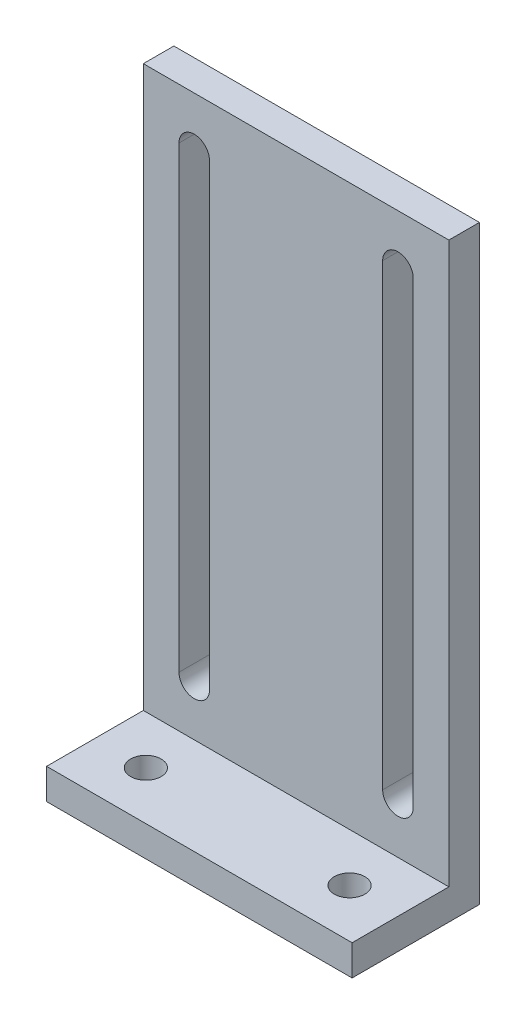
ISO-10303-21;
HEADER;
FILE_DESCRIPTION(('STEP AP214'),'2;1');
FILE_NAME('part.step','',(''),(''),'','','');
FILE_SCHEMA(('AUTOMOTIVE_DESIGN { 1 0 10303 214 1 1 1 1 }'));
ENDSEC;
DATA;
#1=APPLICATION_CONTEXT('core data for automotive mechanical design processes');
#2=APPLICATION_PROTOCOL_DEFINITION('international standard','automotive_design',2000,#1);
#3=PRODUCT_CONTEXT('',#1,'mechanical');
#4=PRODUCT('Part','Part','',(#3));
#5=PRODUCT_RELATED_PRODUCT_CATEGORY('part','',(#4));
#6=PRODUCT_DEFINITION_FORMATION('','',#4);
#7=PRODUCT_DEFINITION_CONTEXT('part definition',#1,'design');
#8=PRODUCT_DEFINITION('design','',#6,#7);
#9=PRODUCT_DEFINITION_SHAPE('','',#8);
#10=(LENGTH_UNIT() NAMED_UNIT(*) SI_UNIT(.MILLI.,.METRE.));
#11=(NAMED_UNIT(*) PLANE_ANGLE_UNIT() SI_UNIT($,.RADIAN.));
#12=(NAMED_UNIT(*) SI_UNIT($,.STERADIAN.) SOLID_ANGLE_UNIT());
#13=UNCERTAINTY_MEASURE_WITH_UNIT(LENGTH_MEASURE(1.E-05),#10,'distance_accuracy_value','');
#14=(GEOMETRIC_REPRESENTATION_CONTEXT(3) GLOBAL_UNCERTAINTY_ASSIGNED_CONTEXT((#13)) GLOBAL_UNIT_ASSIGNED_CONTEXT((#10,
#11,#12)) REPRESENTATION_CONTEXT('',''));
#15=CARTESIAN_POINT('',(0.,0.,0.));
#16=DIRECTION('',(0.,0.,1.));
#17=DIRECTION('',(1.,0.,0.));
#18=AXIS2_PLACEMENT_3D('',#15,#16,#17);
#19=CARTESIAN_POINT('',(0.,3.,0.));
#20=DIRECTION('',(0.,-1.,0.));
#21=DIRECTION('',(0.,0.,-1.));
#22=AXIS2_PLACEMENT_3D('',#19,#20,#21);
#23=PLANE('',#22);
#24=CARTESIAN_POINT('',(-10.,3.,1.5));
#25=DIRECTION('',(0.,1.,0.));
#26=DIRECTION('',(0.,0.,1.));
#27=AXIS2_PLACEMENT_3D('',#24,#25,#26);
#28=CIRCLE('',#27,1.5);
#29=CARTESIAN_POINT('',(-10.,3.,3.));
#30=VERTEX_POINT('',#29);
#31=EDGE_CURVE('E537',#30,#30,#28,.T.);
#32=ORIENTED_EDGE('',*,*,#31,.F.);
#33=EDGE_LOOP('',(#32));
#34=FACE_BOUND('',#33,.T.);
#35=CARTESIAN_POINT('',(9.99999999999999,3.,1.5));
#36=DIRECTION('',(0.,1.,0.));
#37=DIRECTION('',(0.,0.,-1.));
#38=AXIS2_PLACEMENT_3D('',#35,#36,#37);
#39=CIRCLE('',#38,1.5);
#40=CARTESIAN_POINT('',(9.99999999999999,3.,0.));
#41=VERTEX_POINT('',#40);
#42=EDGE_CURVE('E539',#41,#41,#39,.T.);
#43=ORIENTED_EDGE('',*,*,#42,.F.);
#44=EDGE_LOOP('',(#43));
#45=FACE_BOUND('',#44,.T.);
#46=DIRECTION('',(1.,0.,0.));
#47=VECTOR('',#46,1.);
#48=CARTESIAN_POINT('',(-15.,3.,-3.25));
#49=LINE('',#48,#47);
#50=CARTESIAN_POINT('',(-15.,3.,-3.25));
#51=VERTEX_POINT('',#50);
#52=CARTESIAN_POINT('',(15.,3.,-3.25));
#53=VERTEX_POINT('',#52);
#54=EDGE_CURVE('E197',#51,#53,#49,.T.);
#55=ORIENTED_EDGE('',*,*,#54,.F.);
#56=DIRECTION('',(0.,0.,1.));
#57=VECTOR('',#56,1.);
#58=CARTESIAN_POINT('',(-15.,3.,-6.25));
#59=LINE('',#58,#57);
#60=CARTESIAN_POINT('',(-15.,3.,6.25));
#61=VERTEX_POINT('',#60);
#62=EDGE_CURVE('E280',#51,#61,#59,.T.);
#63=ORIENTED_EDGE('',*,*,#62,.T.);
#64=DIRECTION('',(-1.,0.,0.));
#65=VECTOR('',#64,1.);
#66=CARTESIAN_POINT('',(15.,3.,6.25));
#67=LINE('',#66,#65);
#68=CARTESIAN_POINT('',(15.,3.,6.25));
#69=VERTEX_POINT('',#68);
#70=EDGE_CURVE('E275',#69,#61,#67,.T.);
#71=ORIENTED_EDGE('',*,*,#70,.F.);
#72=DIRECTION('',(0.,0.,1.));
#73=VECTOR('',#72,1.);
#74=CARTESIAN_POINT('',(15.,3.,-6.25));
#75=LINE('',#74,#73);
#76=EDGE_CURVE('E272',#53,#69,#75,.T.);
#77=ORIENTED_EDGE('',*,*,#76,.F.);
#78=EDGE_LOOP('',(#55,#63,#71,#77));
#79=FACE_BOUND('',#78,.T.);
#80=ADVANCED_FACE('F43',(#34,#45,#79),#23,.F.);
#81=CARTESIAN_POINT('',(15.,3.,-6.25));
#82=DIRECTION('',(1.,0.,0.));
#83=DIRECTION('',(0.,0.,-1.));
#84=AXIS2_PLACEMENT_3D('',#81,#82,#83);
#85=PLANE('',#84);
#86=DIRECTION('',(0.,0.,1.));
#87=VECTOR('',#86,1.);
#88=CARTESIAN_POINT('',(15.,0.,-6.25));
#89=LINE('',#88,#87);
#90=CARTESIAN_POINT('',(15.,0.,-6.25));
#91=VERTEX_POINT('',#90);
#92=CARTESIAN_POINT('',(15.,0.,6.25));
#93=VERTEX_POINT('',#92);
#94=EDGE_CURVE('E271',#91,#93,#89,.T.);
#95=ORIENTED_EDGE('',*,*,#94,.F.);
#96=DIRECTION('',(0.,-1.,0.));
#97=VECTOR('',#96,1.);
#98=CARTESIAN_POINT('',(15.,3.,-6.25));
#99=LINE('',#98,#97);
#100=CARTESIAN_POINT('',(15.,58.,-6.25));
#101=VERTEX_POINT('',#100);
#102=EDGE_CURVE('E11',#101,#91,#99,.T.);
#103=ORIENTED_EDGE('',*,*,#102,.F.);
#104=DIRECTION('',(0.,0.,-1.));
#105=VECTOR('',#104,1.);
#106=CARTESIAN_POINT('',(15.,58.,-6.25));
#107=LINE('',#106,#105);
#108=CARTESIAN_POINT('',(15.,58.,-3.25));
#109=VERTEX_POINT('',#108);
#110=EDGE_CURVE('E252',#109,#101,#107,.T.);
#111=ORIENTED_EDGE('',*,*,#110,.F.);
#112=DIRECTION('',(0.,-1.,0.));
#113=VECTOR('',#112,1.);
#114=CARTESIAN_POINT('',(15.,58.,-3.25));
#115=LINE('',#114,#113);
#116=EDGE_CURVE('E260',#109,#53,#115,.T.);
#117=ORIENTED_EDGE('',*,*,#116,.T.);
#118=ORIENTED_EDGE('',*,*,#76,.T.);
#119=DIRECTION('',(0.,-1.,0.));
#120=VECTOR('',#119,1.);
#121=CARTESIAN_POINT('',(15.,3.,6.25));
#122=LINE('',#121,#120);
#123=EDGE_CURVE('E47',#69,#93,#122,.T.);
#124=ORIENTED_EDGE('',*,*,#123,.T.);
#125=EDGE_LOOP('',(#95,#103,#111,#117,#118,#124));
#126=FACE_BOUND('',#125,.T.);
#127=ADVANCED_FACE('F45',(#126),#85,.T.);
#128=CARTESIAN_POINT('',(15.,3.,-6.25));
#129=DIRECTION('',(0.,0.,1.));
#130=DIRECTION('',(1.,0.,0.));
#131=AXIS2_PLACEMENT_3D('',#128,#129,#130);
#132=PLANE('',#131);
#133=DIRECTION('',(0.,1.,0.));
#134=VECTOR('',#133,1.);
#135=CARTESIAN_POINT('',(11.5,53.,-6.25));
#136=LINE('',#135,#134);
#137=CARTESIAN_POINT('',(11.5,8.00000000000001,-6.25));
#138=VERTEX_POINT('',#137);
#139=CARTESIAN_POINT('',(11.5,53.,-6.25));
#140=VERTEX_POINT('',#139);
#141=EDGE_CURVE('E159',#138,#140,#136,.T.);
#142=ORIENTED_EDGE('',*,*,#141,.T.);
#143=CARTESIAN_POINT('',(10.,53.,-6.25));
#144=DIRECTION('',(0.,0.,1.));
#145=DIRECTION('',(-1.,0.,0.));
#146=AXIS2_PLACEMENT_3D('',#143,#144,#145);
#147=CIRCLE('',#146,1.5);
#148=CARTESIAN_POINT('',(8.5,53.,-6.25));
#149=VERTEX_POINT('',#148);
#150=EDGE_CURVE('E150',#140,#149,#147,.T.);
#151=ORIENTED_EDGE('',*,*,#150,.T.);
#152=DIRECTION('',(0.,-1.,0.));
#153=VECTOR('',#152,1.);
#154=CARTESIAN_POINT('',(8.5,53.,-6.25));
#155=LINE('',#154,#153);
#156=CARTESIAN_POINT('',(8.50000000000001,8.00000000000001,-6.25));
#157=VERTEX_POINT('',#156);
#158=EDGE_CURVE('E162',#149,#157,#155,.T.);
#159=ORIENTED_EDGE('',*,*,#158,.T.);
#160=CARTESIAN_POINT('',(10.,8.,-6.25));
#161=DIRECTION('',(0.,0.,1.));
#162=DIRECTION('',(-1.,0.,0.));
#163=AXIS2_PLACEMENT_3D('',#160,#161,#162);
#164=CIRCLE('',#163,1.49999999999999);
#165=EDGE_CURVE('E61',#157,#138,#164,.T.);
#166=ORIENTED_EDGE('',*,*,#165,.T.);
#167=EDGE_LOOP('',(#142,#151,#159,#166));
#168=FACE_BOUND('',#167,.T.);
#169=DIRECTION('',(0.,1.,0.));
#170=VECTOR('',#169,1.);
#171=CARTESIAN_POINT('',(-8.50000000000001,53.,-6.25));
#172=LINE('',#171,#170);
#173=CARTESIAN_POINT('',(-8.50000000000001,8.,-6.25));
#174=VERTEX_POINT('',#173);
#175=CARTESIAN_POINT('',(-8.50000000000001,53.,-6.25));
#176=VERTEX_POINT('',#175);
#177=EDGE_CURVE('E207',#174,#176,#172,.T.);
#178=ORIENTED_EDGE('',*,*,#177,.T.);
#179=CARTESIAN_POINT('',(-10.,53.,-6.25));
#180=DIRECTION('',(0.,0.,1.));
#181=DIRECTION('',(1.,0.,0.));
#182=AXIS2_PLACEMENT_3D('',#179,#180,#181);
#183=CIRCLE('',#182,1.5);
#184=CARTESIAN_POINT('',(-11.5,53.,-6.25));
#185=VERTEX_POINT('',#184);
#186=EDGE_CURVE('E223',#176,#185,#183,.T.);
#187=ORIENTED_EDGE('',*,*,#186,.T.);
#188=DIRECTION('',(0.,-1.,0.));
#189=VECTOR('',#188,1.);
#190=CARTESIAN_POINT('',(-11.5,53.,-6.25));
#191=LINE('',#190,#189);
#192=CARTESIAN_POINT('',(-11.5,7.99999999999999,-6.25));
#193=VERTEX_POINT('',#192);
#194=EDGE_CURVE('E238',#185,#193,#191,.T.);
#195=ORIENTED_EDGE('',*,*,#194,.T.);
#196=CARTESIAN_POINT('',(-10.,8.00000000000001,-6.25));
#197=DIRECTION('',(0.,0.,1.));
#198=DIRECTION('',(1.,0.,0.));
#199=AXIS2_PLACEMENT_3D('',#196,#197,#198);
#200=CIRCLE('',#199,1.49999999999999);
#201=EDGE_CURVE('E69',#193,#174,#200,.T.);
#202=ORIENTED_EDGE('',*,*,#201,.T.);
#203=EDGE_LOOP('',(#178,#187,#195,#202));
#204=FACE_BOUND('',#203,.T.);
#205=DIRECTION('',(-1.,0.,0.));
#206=VECTOR('',#205,1.);
#207=CARTESIAN_POINT('',(15.,0.,-6.25));
#208=LINE('',#207,#206);
#209=CARTESIAN_POINT('',(-15.,0.,-6.25));
#210=VERTEX_POINT('',#209);
#211=EDGE_CURVE('E276',#91,#210,#208,.T.);
#212=ORIENTED_EDGE('',*,*,#211,.T.);
#213=DIRECTION('',(0.,-1.,0.));
#214=VECTOR('',#213,1.);
#215=CARTESIAN_POINT('',(-15.,3.,-6.25));
#216=LINE('',#215,#214);
#217=CARTESIAN_POINT('',(-15.,58.,-6.25));
#218=VERTEX_POINT('',#217);
#219=EDGE_CURVE('E53',#218,#210,#216,.T.);
#220=ORIENTED_EDGE('',*,*,#219,.F.);
#221=DIRECTION('',(-1.,0.,0.));
#222=VECTOR('',#221,1.);
#223=CARTESIAN_POINT('',(-15.,58.,-6.25));
#224=LINE('',#223,#222);
#225=EDGE_CURVE('E256',#101,#218,#224,.T.);
#226=ORIENTED_EDGE('',*,*,#225,.F.);
#227=ORIENTED_EDGE('',*,*,#102,.T.);
#228=EDGE_LOOP('',(#212,#220,#226,#227));
#229=FACE_BOUND('',#228,.T.);
#230=ADVANCED_FACE('F167',(#168,#204,#229),#132,.F.);
#231=CARTESIAN_POINT('',(-15.,3.,-6.25));
#232=DIRECTION('',(1.,0.,0.));
#233=DIRECTION('',(0.,0.,-1.));
#234=AXIS2_PLACEMENT_3D('',#231,#232,#233);
#235=PLANE('',#234);
#236=DIRECTION('',(0.,0.,1.));
#237=VECTOR('',#236,1.);
#238=CARTESIAN_POINT('',(-15.,0.,-6.25));
#239=LINE('',#238,#237);
#240=CARTESIAN_POINT('',(-15.,0.,6.25));
#241=VERTEX_POINT('',#240);
#242=EDGE_CURVE('E290',#210,#241,#239,.T.);
#243=ORIENTED_EDGE('',*,*,#242,.T.);
#244=DIRECTION('',(0.,-1.,0.));
#245=VECTOR('',#244,1.);
#246=CARTESIAN_POINT('',(-15.,3.,6.25));
#247=LINE('',#246,#245);
#248=EDGE_CURVE('E298',#61,#241,#247,.T.);
#249=ORIENTED_EDGE('',*,*,#248,.F.);
#250=ORIENTED_EDGE('',*,*,#62,.F.);
#251=DIRECTION('',(0.,-1.,0.));
#252=VECTOR('',#251,1.);
#253=CARTESIAN_POINT('',(-15.,58.,-3.25));
#254=LINE('',#253,#252);
#255=CARTESIAN_POINT('',(-15.,58.,-3.25));
#256=VERTEX_POINT('',#255);
#257=EDGE_CURVE('E267',#256,#51,#254,.T.);
#258=ORIENTED_EDGE('',*,*,#257,.F.);
#259=DIRECTION('',(0.,0.,1.));
#260=VECTOR('',#259,1.);
#261=CARTESIAN_POINT('',(-15.,58.,-6.25));
#262=LINE('',#261,#260);
#263=EDGE_CURVE('E245',#218,#256,#262,.T.);
#264=ORIENTED_EDGE('',*,*,#263,.F.);
#265=ORIENTED_EDGE('',*,*,#219,.T.);
#266=EDGE_LOOP('',(#243,#249,#250,#258,#264,#265));
#267=FACE_BOUND('',#266,.T.);
#268=ADVANCED_FACE('F317',(#267),#235,.F.);
#269=CARTESIAN_POINT('',(15.,3.,6.25));
#270=DIRECTION('',(0.,0.,1.));
#271=DIRECTION('',(1.,0.,0.));
#272=AXIS2_PLACEMENT_3D('',#269,#270,#271);
#273=PLANE('',#272);
#274=DIRECTION('',(-1.,0.,0.));
#275=VECTOR('',#274,1.);
#276=CARTESIAN_POINT('',(15.,0.,6.25));
#277=LINE('',#276,#275);
#278=EDGE_CURVE('E286',#93,#241,#277,.T.);
#279=ORIENTED_EDGE('',*,*,#278,.F.);
#280=ORIENTED_EDGE('',*,*,#123,.F.);
#281=ORIENTED_EDGE('',*,*,#70,.T.);
#282=ORIENTED_EDGE('',*,*,#248,.T.);
#283=EDGE_LOOP('',(#279,#280,#281,#282));
#284=FACE_BOUND('',#283,.T.);
#285=ADVANCED_FACE('F308',(#284),#273,.T.);
#286=CARTESIAN_POINT('',(0.,0.,0.));
#287=DIRECTION('',(0.,-1.,0.));
#288=DIRECTION('',(0.,0.,-1.));
#289=AXIS2_PLACEMENT_3D('',#286,#287,#288);
#290=PLANE('',#289);
#291=CARTESIAN_POINT('',(-10.,0.,1.5));
#292=DIRECTION('',(0.,1.,0.));
#293=DIRECTION('',(0.,0.,1.));
#294=AXIS2_PLACEMENT_3D('',#291,#292,#293);
#295=CIRCLE('',#294,1.5);
#296=CARTESIAN_POINT('',(-10.,0.,3.));
#297=VERTEX_POINT('',#296);
#298=EDGE_CURVE('E217',#297,#297,#295,.T.);
#299=ORIENTED_EDGE('',*,*,#298,.T.);
#300=EDGE_LOOP('',(#299));
#301=FACE_BOUND('',#300,.T.);
#302=CARTESIAN_POINT('',(9.99999999999999,0.,1.5));
#303=DIRECTION('',(0.,1.,0.));
#304=DIRECTION('',(0.,0.,-1.));
#305=AXIS2_PLACEMENT_3D('',#302,#303,#304);
#306=CIRCLE('',#305,1.5);
#307=CARTESIAN_POINT('',(9.99999999999999,0.,0.));
#308=VERTEX_POINT('',#307);
#309=EDGE_CURVE('E178',#308,#308,#306,.T.);
#310=ORIENTED_EDGE('',*,*,#309,.T.);
#311=EDGE_LOOP('',(#310));
#312=FACE_BOUND('',#311,.T.);
#313=ORIENTED_EDGE('',*,*,#94,.T.);
#314=ORIENTED_EDGE('',*,*,#278,.T.);
#315=ORIENTED_EDGE('',*,*,#242,.F.);
#316=ORIENTED_EDGE('',*,*,#211,.F.);
#317=EDGE_LOOP('',(#313,#314,#315,#316));
#318=FACE_BOUND('',#317,.T.);
#319=ADVANCED_FACE('F312',(#301,#312,#318),#290,.T.);
#320=CARTESIAN_POINT('',(-15.,58.,-3.25));
#321=DIRECTION('',(0.,0.,-1.));
#322=DIRECTION('',(-1.,0.,0.));
#323=AXIS2_PLACEMENT_3D('',#320,#321,#322);
#324=PLANE('',#323);
#325=DIRECTION('',(0.,-1.,0.));
#326=VECTOR('',#325,1.);
#327=CARTESIAN_POINT('',(8.5,53.,-3.25));
#328=LINE('',#327,#326);
#329=CARTESIAN_POINT('',(8.5,53.,-3.25));
#330=VERTEX_POINT('',#329);
#331=CARTESIAN_POINT('',(8.50000000000001,8.00000000000001,-3.25));
#332=VERTEX_POINT('',#331);
#333=EDGE_CURVE('E187',#330,#332,#328,.T.);
#334=ORIENTED_EDGE('',*,*,#333,.F.);
#335=CARTESIAN_POINT('',(10.,53.,-3.25));
#336=DIRECTION('',(0.,0.,1.));
#337=DIRECTION('',(-1.,0.,0.));
#338=AXIS2_PLACEMENT_3D('',#335,#336,#337);
#339=CIRCLE('',#338,1.5);
#340=CARTESIAN_POINT('',(11.5,53.,-3.25));
#341=VERTEX_POINT('',#340);
#342=EDGE_CURVE('E153',#341,#330,#339,.T.);
#343=ORIENTED_EDGE('',*,*,#342,.F.);
#344=DIRECTION('',(0.,1.,0.));
#345=VECTOR('',#344,1.);
#346=CARTESIAN_POINT('',(11.5,53.,-3.25));
#347=LINE('',#346,#345);
#348=CARTESIAN_POINT('',(11.5,8.00000000000001,-3.25));
#349=VERTEX_POINT('',#348);
#350=EDGE_CURVE('E171',#349,#341,#347,.T.);
#351=ORIENTED_EDGE('',*,*,#350,.F.);
#352=CARTESIAN_POINT('',(10.,8.,-3.25));
#353=DIRECTION('',(0.,0.,1.));
#354=DIRECTION('',(-1.,0.,0.));
#355=AXIS2_PLACEMENT_3D('',#352,#353,#354);
#356=CIRCLE('',#355,1.49999999999999);
#357=EDGE_CURVE('E175',#332,#349,#356,.T.);
#358=ORIENTED_EDGE('',*,*,#357,.F.);
#359=EDGE_LOOP('',(#334,#343,#351,#358));
#360=FACE_BOUND('',#359,.T.);
#361=DIRECTION('',(0.,-1.,0.));
#362=VECTOR('',#361,1.);
#363=CARTESIAN_POINT('',(-11.5,53.,-3.25));
#364=LINE('',#363,#362);
#365=CARTESIAN_POINT('',(-11.5,53.,-3.25));
#366=VERTEX_POINT('',#365);
#367=CARTESIAN_POINT('',(-11.5,7.99999999999999,-3.25));
#368=VERTEX_POINT('',#367);
#369=EDGE_CURVE('E227',#366,#368,#364,.T.);
#370=ORIENTED_EDGE('',*,*,#369,.F.);
#371=CARTESIAN_POINT('',(-10.,53.,-3.25));
#372=DIRECTION('',(0.,0.,1.));
#373=DIRECTION('',(1.,0.,0.));
#374=AXIS2_PLACEMENT_3D('',#371,#372,#373);
#375=CIRCLE('',#374,1.5);
#376=CARTESIAN_POINT('',(-8.50000000000001,53.,-3.25));
#377=VERTEX_POINT('',#376);
#378=EDGE_CURVE('E188',#377,#366,#375,.T.);
#379=ORIENTED_EDGE('',*,*,#378,.F.);
#380=DIRECTION('',(0.,1.,0.));
#381=VECTOR('',#380,1.);
#382=CARTESIAN_POINT('',(-8.50000000000001,53.,-3.25));
#383=LINE('',#382,#381);
#384=CARTESIAN_POINT('',(-8.50000000000001,8.,-3.25));
#385=VERTEX_POINT('',#384);
#386=EDGE_CURVE('E218',#385,#377,#383,.T.);
#387=ORIENTED_EDGE('',*,*,#386,.F.);
#388=CARTESIAN_POINT('',(-10.,8.00000000000001,-3.25));
#389=DIRECTION('',(0.,0.,1.));
#390=DIRECTION('',(1.,0.,0.));
#391=AXIS2_PLACEMENT_3D('',#388,#389,#390);
#392=CIRCLE('',#391,1.49999999999999);
#393=EDGE_CURVE('E222',#368,#385,#392,.T.);
#394=ORIENTED_EDGE('',*,*,#393,.F.);
#395=EDGE_LOOP('',(#370,#379,#387,#394));
#396=FACE_BOUND('',#395,.T.);
#397=ORIENTED_EDGE('',*,*,#54,.T.);
#398=ORIENTED_EDGE('',*,*,#116,.F.);
#399=DIRECTION('',(1.,0.,0.));
#400=VECTOR('',#399,1.);
#401=CARTESIAN_POINT('',(-15.,58.,-3.25));
#402=LINE('',#401,#400);
#403=EDGE_CURVE('E249',#256,#109,#402,.T.);
#404=ORIENTED_EDGE('',*,*,#403,.F.);
#405=ORIENTED_EDGE('',*,*,#257,.T.);
#406=EDGE_LOOP('',(#397,#398,#404,#405));
#407=FACE_BOUND('',#406,.T.);
#408=ADVANCED_FACE('F325',(#360,#396,#407),#324,.F.);
#409=CARTESIAN_POINT('',(0.,58.,0.));
#410=DIRECTION('',(0.,1.,0.));
#411=DIRECTION('',(0.,0.,1.));
#412=AXIS2_PLACEMENT_3D('',#409,#410,#411);
#413=PLANE('',#412);
#414=ORIENTED_EDGE('',*,*,#263,.T.);
#415=ORIENTED_EDGE('',*,*,#403,.T.);
#416=ORIENTED_EDGE('',*,*,#110,.T.);
#417=ORIENTED_EDGE('',*,*,#225,.T.);
#418=EDGE_LOOP('',(#414,#415,#416,#417));
#419=FACE_BOUND('',#418,.T.);
#420=ADVANCED_FACE('F321',(#419),#413,.T.);
#421=CARTESIAN_POINT('',(-10.,53.,-6.25));
#422=DIRECTION('',(0.,0.,1.));
#423=DIRECTION('',(1.,0.,0.));
#424=AXIS2_PLACEMENT_3D('',#421,#422,#423);
#425=CYLINDRICAL_SURFACE('',#424,1.5);
#426=ORIENTED_EDGE('',*,*,#378,.T.);
#427=DIRECTION('',(0.,0.,1.));
#428=VECTOR('',#427,1.);
#429=CARTESIAN_POINT('',(-11.5,53.,-6.25));
#430=LINE('',#429,#428);
#431=EDGE_CURVE('E203',#185,#366,#430,.T.);
#432=ORIENTED_EDGE('',*,*,#431,.F.);
#433=ORIENTED_EDGE('',*,*,#186,.F.);
#434=DIRECTION('',(0.,0.,1.));
#435=VECTOR('',#434,1.);
#436=CARTESIAN_POINT('',(-8.50000000000001,53.,-6.25));
#437=LINE('',#436,#435);
#438=EDGE_CURVE('E214',#176,#377,#437,.T.);
#439=ORIENTED_EDGE('',*,*,#438,.T.);
#440=EDGE_LOOP('',(#426,#432,#433,#439));
#441=FACE_BOUND('',#440,.T.);
#442=ADVANCED_FACE('F369',(#441),#425,.F.);
#443=CARTESIAN_POINT('',(-8.50000000000001,53.,-6.25));
#444=DIRECTION('',(1.,0.,0.));
#445=DIRECTION('',(0.,1.,0.));
#446=AXIS2_PLACEMENT_3D('',#443,#444,#445);
#447=PLANE('',#446);
#448=ORIENTED_EDGE('',*,*,#386,.T.);
#449=ORIENTED_EDGE('',*,*,#438,.F.);
#450=ORIENTED_EDGE('',*,*,#177,.F.);
#451=DIRECTION('',(0.,0.,1.));
#452=VECTOR('',#451,1.);
#453=CARTESIAN_POINT('',(-8.50000000000001,8.,-6.25));
#454=LINE('',#453,#452);
#455=EDGE_CURVE('E211',#174,#385,#454,.T.);
#456=ORIENTED_EDGE('',*,*,#455,.T.);
#457=EDGE_LOOP('',(#448,#449,#450,#456));
#458=FACE_BOUND('',#457,.T.);
#459=ADVANCED_FACE('F374',(#458),#447,.F.);
#460=CARTESIAN_POINT('',(-10.,8.00000000000001,-6.25));
#461=DIRECTION('',(0.,0.,1.));
#462=DIRECTION('',(1.,0.,0.));
#463=AXIS2_PLACEMENT_3D('',#460,#461,#462);
#464=CYLINDRICAL_SURFACE('',#463,1.49999999999999);
#465=ORIENTED_EDGE('',*,*,#393,.T.);
#466=ORIENTED_EDGE('',*,*,#455,.F.);
#467=ORIENTED_EDGE('',*,*,#201,.F.);
#468=DIRECTION('',(0.,0.,1.));
#469=VECTOR('',#468,1.);
#470=CARTESIAN_POINT('',(-11.5,7.99999999999999,-6.25));
#471=LINE('',#470,#469);
#472=EDGE_CURVE('E208',#193,#368,#471,.T.);
#473=ORIENTED_EDGE('',*,*,#472,.T.);
#474=EDGE_LOOP('',(#465,#466,#467,#473));
#475=FACE_BOUND('',#474,.T.);
#476=ADVANCED_FACE('F382',(#475),#464,.F.);
#477=CARTESIAN_POINT('',(-11.5,53.,-6.25));
#478=DIRECTION('',(-1.,0.,0.));
#479=DIRECTION('',(0.,-1.,0.));
#480=AXIS2_PLACEMENT_3D('',#477,#478,#479);
#481=PLANE('',#480);
#482=ORIENTED_EDGE('',*,*,#369,.T.);
#483=ORIENTED_EDGE('',*,*,#472,.F.);
#484=ORIENTED_EDGE('',*,*,#194,.F.);
#485=ORIENTED_EDGE('',*,*,#431,.T.);
#486=EDGE_LOOP('',(#482,#483,#484,#485));
#487=FACE_BOUND('',#486,.T.);
#488=ADVANCED_FACE('F390',(#487),#481,.F.);
#489=CARTESIAN_POINT('',(10.,53.,-6.25));
#490=DIRECTION('',(0.,0.,1.));
#491=DIRECTION('',(1.,0.,0.));
#492=AXIS2_PLACEMENT_3D('',#489,#490,#491);
#493=CYLINDRICAL_SURFACE('',#492,1.5);
#494=ORIENTED_EDGE('',*,*,#342,.T.);
#495=DIRECTION('',(0.,0.,1.));
#496=VECTOR('',#495,1.);
#497=CARTESIAN_POINT('',(8.5,53.,-6.25));
#498=LINE('',#497,#496);
#499=EDGE_CURVE('E146',#149,#330,#498,.T.);
#500=ORIENTED_EDGE('',*,*,#499,.F.);
#501=ORIENTED_EDGE('',*,*,#150,.F.);
#502=DIRECTION('',(0.,0.,1.));
#503=VECTOR('',#502,1.);
#504=CARTESIAN_POINT('',(11.5,53.,-6.25));
#505=LINE('',#504,#503);
#506=EDGE_CURVE('E194',#140,#341,#505,.T.);
#507=ORIENTED_EDGE('',*,*,#506,.T.);
#508=EDGE_LOOP('',(#494,#500,#501,#507));
#509=FACE_BOUND('',#508,.T.);
#510=ADVANCED_FACE('F148',(#509),#493,.F.);
#511=CARTESIAN_POINT('',(11.5,53.,-6.25));
#512=DIRECTION('',(1.,0.,0.));
#513=DIRECTION('',(0.,1.,0.));
#514=AXIS2_PLACEMENT_3D('',#511,#512,#513);
#515=PLANE('',#514);
#516=ORIENTED_EDGE('',*,*,#350,.T.);
#517=ORIENTED_EDGE('',*,*,#506,.F.);
#518=ORIENTED_EDGE('',*,*,#141,.F.);
#519=DIRECTION('',(0.,0.,1.));
#520=VECTOR('',#519,1.);
#521=CARTESIAN_POINT('',(11.5,8.00000000000001,-6.25));
#522=LINE('',#521,#520);
#523=EDGE_CURVE('E198',#138,#349,#522,.T.);
#524=ORIENTED_EDGE('',*,*,#523,.T.);
#525=EDGE_LOOP('',(#516,#517,#518,#524));
#526=FACE_BOUND('',#525,.T.);
#527=ADVANCED_FACE('F404',(#526),#515,.F.);
#528=CARTESIAN_POINT('',(10.,8.,-6.25));
#529=DIRECTION('',(0.,0.,1.));
#530=DIRECTION('',(1.,0.,0.));
#531=AXIS2_PLACEMENT_3D('',#528,#529,#530);
#532=CYLINDRICAL_SURFACE('',#531,1.49999999999999);
#533=ORIENTED_EDGE('',*,*,#357,.T.);
#534=ORIENTED_EDGE('',*,*,#523,.F.);
#535=ORIENTED_EDGE('',*,*,#165,.F.);
#536=DIRECTION('',(0.,0.,1.));
#537=VECTOR('',#536,1.);
#538=CARTESIAN_POINT('',(8.50000000000001,8.00000000000001,-6.25));
#539=LINE('',#538,#537);
#540=EDGE_CURVE('E158',#157,#332,#539,.T.);
#541=ORIENTED_EDGE('',*,*,#540,.T.);
#542=EDGE_LOOP('',(#533,#534,#535,#541));
#543=FACE_BOUND('',#542,.T.);
#544=ADVANCED_FACE('F411',(#543),#532,.F.);
#545=CARTESIAN_POINT('',(8.5,53.,-6.25));
#546=DIRECTION('',(-1.,0.,0.));
#547=DIRECTION('',(0.,-1.,0.));
#548=AXIS2_PLACEMENT_3D('',#545,#546,#547);
#549=PLANE('',#548);
#550=ORIENTED_EDGE('',*,*,#333,.T.);
#551=ORIENTED_EDGE('',*,*,#540,.F.);
#552=ORIENTED_EDGE('',*,*,#158,.F.);
#553=ORIENTED_EDGE('',*,*,#499,.T.);
#554=EDGE_LOOP('',(#550,#551,#552,#553));
#555=FACE_BOUND('',#554,.T.);
#556=ADVANCED_FACE('F163',(#555),#549,.F.);
#557=CARTESIAN_POINT('',(9.99999999999999,0.,1.5));
#558=DIRECTION('',(0.,1.,0.));
#559=DIRECTION('',(0.,0.,1.));
#560=AXIS2_PLACEMENT_3D('',#557,#558,#559);
#561=CYLINDRICAL_SURFACE('',#560,1.5);
#562=ORIENTED_EDGE('',*,*,#309,.F.);
#563=EDGE_LOOP('',(#562));
#564=FACE_BOUND('',#563,.T.);
#565=ORIENTED_EDGE('',*,*,#42,.T.);
#566=EDGE_LOOP('',(#565));
#567=FACE_BOUND('',#566,.T.);
#568=ADVANCED_FACE('F425',(#564,#567),#561,.F.);
#569=CARTESIAN_POINT('',(-10.,0.,1.5));
#570=DIRECTION('',(0.,1.,0.));
#571=DIRECTION('',(0.,0.,1.));
#572=AXIS2_PLACEMENT_3D('',#569,#570,#571);
#573=CYLINDRICAL_SURFACE('',#572,1.5);
#574=ORIENTED_EDGE('',*,*,#298,.F.);
#575=EDGE_LOOP('',(#574));
#576=FACE_BOUND('',#575,.T.);
#577=ORIENTED_EDGE('',*,*,#31,.T.);
#578=EDGE_LOOP('',(#577));
#579=FACE_BOUND('',#578,.T.);
#580=ADVANCED_FACE('F431',(#576,#579),#573,.F.);
#581=CLOSED_SHELL('',(#80,#127,#230,#268,#285,#319,#408,#420,#442,#459,#476,#488,#510,#527,#544,
#556,#568,#580));
#582=MANIFOLD_SOLID_BREP('B2',#581);
#583=ADVANCED_BREP_SHAPE_REPRESENTATION('',(#18,#582),#14);
#584=SHAPE_DEFINITION_REPRESENTATION(#9,#583);
ENDSEC;
END-ISO-10303-21;
